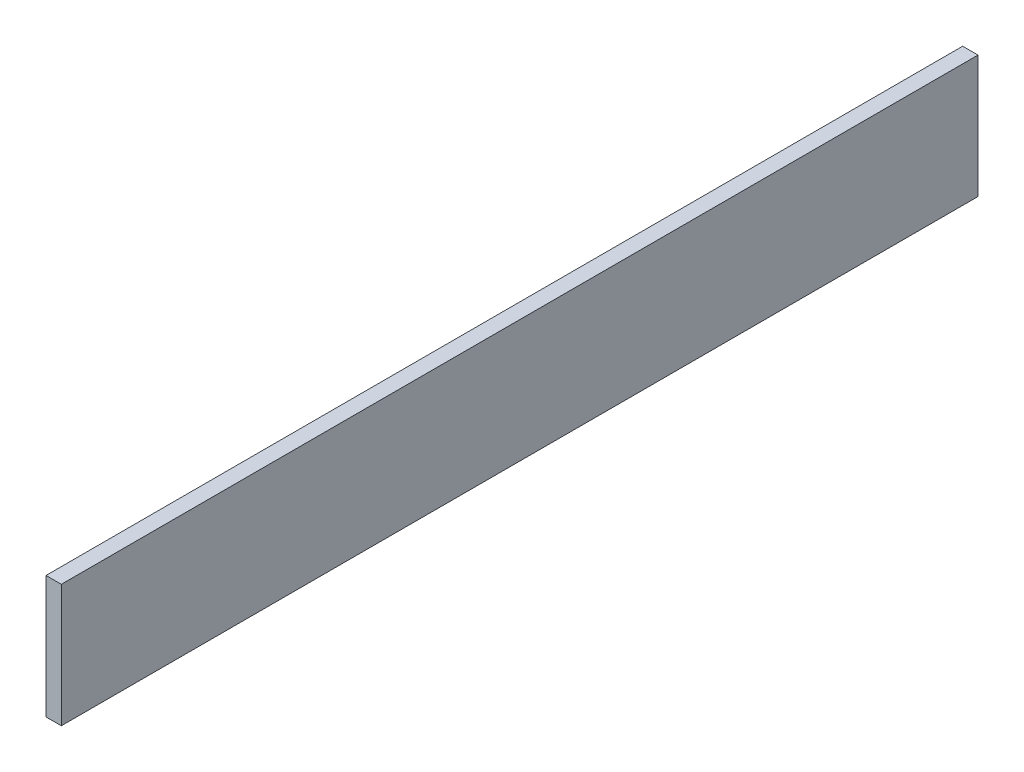
ISO-10303-21;
HEADER;
FILE_DESCRIPTION(('STEP AP214'),'2;1');
FILE_NAME('part.step','',(''),(''),'','','');
FILE_SCHEMA(('AUTOMOTIVE_DESIGN { 1 0 10303 214 1 1 1 1 }'));
ENDSEC;
DATA;
#1=APPLICATION_CONTEXT('core data for automotive mechanical design processes');
#2=APPLICATION_PROTOCOL_DEFINITION('international standard','automotive_design',2000,#1);
#3=PRODUCT_CONTEXT('',#1,'mechanical');
#4=PRODUCT('Part','Part','',(#3));
#5=PRODUCT_RELATED_PRODUCT_CATEGORY('part','',(#4));
#6=PRODUCT_DEFINITION_FORMATION('','',#4);
#7=PRODUCT_DEFINITION_CONTEXT('part definition',#1,'design');
#8=PRODUCT_DEFINITION('design','',#6,#7);
#9=PRODUCT_DEFINITION_SHAPE('','',#8);
#10=(LENGTH_UNIT() NAMED_UNIT(*) SI_UNIT(.MILLI.,.METRE.));
#11=(NAMED_UNIT(*) PLANE_ANGLE_UNIT() SI_UNIT($,.RADIAN.));
#12=(NAMED_UNIT(*) SI_UNIT($,.STERADIAN.) SOLID_ANGLE_UNIT());
#13=UNCERTAINTY_MEASURE_WITH_UNIT(LENGTH_MEASURE(1.E-05),#10,'distance_accuracy_value','');
#14=(GEOMETRIC_REPRESENTATION_CONTEXT(3) GLOBAL_UNCERTAINTY_ASSIGNED_CONTEXT((#13)) GLOBAL_UNIT_ASSIGNED_CONTEXT((#10,
#11,#12)) REPRESENTATION_CONTEXT('',''));
#15=CARTESIAN_POINT('',(0.,0.,0.));
#16=DIRECTION('',(0.,0.,1.));
#17=DIRECTION('',(1.,0.,0.));
#18=AXIS2_PLACEMENT_3D('',#15,#16,#17);
#19=CARTESIAN_POINT('',(3.175,11.5950477916797,1.0931424376821));
#20=DIRECTION('',(0.,0.,-1.));
#21=DIRECTION('',(0.,1.,0.));
#22=AXIS2_PLACEMENT_3D('',#19,#20,#21);
#23=PLANE('',#22);
#24=DIRECTION('',(0.,-1.,0.));
#25=VECTOR('',#24,1.);
#26=CARTESIAN_POINT('',(0.,11.5950477916797,1.0931424376821));
#27=LINE('',#26,#25);
#28=CARTESIAN_POINT('',(0.,11.5950477916797,1.0931424376821));
#29=VERTEX_POINT('',#28);
#30=CARTESIAN_POINT('',(0.,-13.8049522083203,1.0931424376821));
#31=VERTEX_POINT('',#30);
#32=EDGE_CURVE('E115',#29,#31,#27,.T.);
#33=ORIENTED_EDGE('',*,*,#32,.T.);
#34=DIRECTION('',(-1.,0.,0.));
#35=VECTOR('',#34,1.);
#36=CARTESIAN_POINT('',(3.175,-13.8049522083203,1.0931424376821));
#37=LINE('',#36,#35);
#38=CARTESIAN_POINT('',(3.175,-13.8049522083203,1.0931424376821));
#39=VERTEX_POINT('',#38);
#40=EDGE_CURVE('E11',#39,#31,#37,.T.);
#41=ORIENTED_EDGE('',*,*,#40,.F.);
#42=DIRECTION('',(0.,-1.,0.));
#43=VECTOR('',#42,1.);
#44=CARTESIAN_POINT('',(3.175,11.5950477916797,1.0931424376821));
#45=LINE('',#44,#43);
#46=CARTESIAN_POINT('',(3.175,11.5950477916797,1.0931424376821));
#47=VERTEX_POINT('',#46);
#48=EDGE_CURVE('E97',#47,#39,#45,.T.);
#49=ORIENTED_EDGE('',*,*,#48,.F.);
#50=DIRECTION('',(-1.,0.,0.));
#51=VECTOR('',#50,1.);
#52=CARTESIAN_POINT('',(3.175,11.5950477916797,1.0931424376821));
#53=LINE('',#52,#51);
#54=EDGE_CURVE('E111',#47,#29,#53,.T.);
#55=ORIENTED_EDGE('',*,*,#54,.T.);
#56=EDGE_LOOP('',(#33,#41,#49,#55));
#57=FACE_BOUND('',#56,.T.);
#58=ADVANCED_FACE('F39',(#57),#23,.F.);
#59=CARTESIAN_POINT('',(3.175,-13.8049522083203,1.0931424376821));
#60=DIRECTION('',(0.,1.,0.));
#61=DIRECTION('',(0.,0.,1.));
#62=AXIS2_PLACEMENT_3D('',#59,#60,#61);
#63=PLANE('',#62);
#64=DIRECTION('',(0.,0.,-1.));
#65=VECTOR('',#64,1.);
#66=CARTESIAN_POINT('',(0.,-13.8049522083203,1.0931424376821));
#67=LINE('',#66,#65);
#68=CARTESIAN_POINT('',(0.,-13.8049522083203,-188.898857562318));
#69=VERTEX_POINT('',#68);
#70=EDGE_CURVE('E102',#31,#69,#67,.T.);
#71=ORIENTED_EDGE('',*,*,#70,.T.);
#72=DIRECTION('',(-1.,0.,0.));
#73=VECTOR('',#72,1.);
#74=CARTESIAN_POINT('',(3.175,-13.8049522083203,-188.898857562318));
#75=LINE('',#74,#73);
#76=CARTESIAN_POINT('',(3.175,-13.8049522083203,-188.898857562318));
#77=VERTEX_POINT('',#76);
#78=EDGE_CURVE('E48',#77,#69,#75,.T.);
#79=ORIENTED_EDGE('',*,*,#78,.F.);
#80=DIRECTION('',(0.,0.,-1.));
#81=VECTOR('',#80,1.);
#82=CARTESIAN_POINT('',(3.175,-13.8049522083203,1.0931424376821));
#83=LINE('',#82,#81);
#84=EDGE_CURVE('E91',#39,#77,#83,.T.);
#85=ORIENTED_EDGE('',*,*,#84,.F.);
#86=ORIENTED_EDGE('',*,*,#40,.T.);
#87=EDGE_LOOP('',(#71,#79,#85,#86));
#88=FACE_BOUND('',#87,.T.);
#89=ADVANCED_FACE('F101',(#88),#63,.F.);
#90=CARTESIAN_POINT('',(3.175,11.5950477916797,-188.898857562318));
#91=DIRECTION('',(0.,0.,1.));
#92=DIRECTION('',(1.,0.,0.));
#93=AXIS2_PLACEMENT_3D('',#90,#91,#92);
#94=PLANE('',#93);
#95=DIRECTION('',(0.,1.,0.));
#96=VECTOR('',#95,1.);
#97=CARTESIAN_POINT('',(0.,11.5950477916797,-188.898857562318));
#98=LINE('',#97,#96);
#99=CARTESIAN_POINT('',(0.,11.5950477916797,-188.898857562318));
#100=VERTEX_POINT('',#99);
#101=EDGE_CURVE('E77',#69,#100,#98,.T.);
#102=ORIENTED_EDGE('',*,*,#101,.T.);
#103=DIRECTION('',(-1.,0.,0.));
#104=VECTOR('',#103,1.);
#105=CARTESIAN_POINT('',(3.175,11.5950477916797,-188.898857562318));
#106=LINE('',#105,#104);
#107=CARTESIAN_POINT('',(3.175,11.5950477916797,-188.898857562318));
#108=VERTEX_POINT('',#107);
#109=EDGE_CURVE('E104',#108,#100,#106,.T.);
#110=ORIENTED_EDGE('',*,*,#109,.F.);
#111=DIRECTION('',(0.,1.,0.));
#112=VECTOR('',#111,1.);
#113=CARTESIAN_POINT('',(3.175,11.5950477916797,-188.898857562318));
#114=LINE('',#113,#112);
#115=EDGE_CURVE('E95',#77,#108,#114,.T.);
#116=ORIENTED_EDGE('',*,*,#115,.F.);
#117=ORIENTED_EDGE('',*,*,#78,.T.);
#118=EDGE_LOOP('',(#102,#110,#116,#117));
#119=FACE_BOUND('',#118,.T.);
#120=ADVANCED_FACE('F105',(#119),#94,.F.);
#121=CARTESIAN_POINT('',(3.175,11.5950477916797,1.0931424376821));
#122=DIRECTION('',(0.,-1.,0.));
#123=DIRECTION('',(0.,0.,-1.));
#124=AXIS2_PLACEMENT_3D('',#121,#122,#123);
#125=PLANE('',#124);
#126=DIRECTION('',(0.,0.,1.));
#127=VECTOR('',#126,1.);
#128=CARTESIAN_POINT('',(0.,11.5950477916797,1.0931424376821));
#129=LINE('',#128,#127);
#130=EDGE_CURVE('E83',#100,#29,#129,.T.);
#131=ORIENTED_EDGE('',*,*,#130,.T.);
#132=ORIENTED_EDGE('',*,*,#54,.F.);
#133=DIRECTION('',(0.,0.,1.));
#134=VECTOR('',#133,1.);
#135=CARTESIAN_POINT('',(3.175,11.5950477916797,1.0931424376821));
#136=LINE('',#135,#134);
#137=EDGE_CURVE('E56',#108,#47,#136,.T.);
#138=ORIENTED_EDGE('',*,*,#137,.F.);
#139=ORIENTED_EDGE('',*,*,#109,.T.);
#140=EDGE_LOOP('',(#131,#132,#138,#139));
#141=FACE_BOUND('',#140,.T.);
#142=ADVANCED_FACE('F125',(#141),#125,.F.);
#143=CARTESIAN_POINT('',(3.175,0.,0.));
#144=DIRECTION('',(1.,0.,0.));
#145=DIRECTION('',(0.,0.,-1.));
#146=AXIS2_PLACEMENT_3D('',#143,#144,#145);
#147=PLANE('',#146);
#148=ORIENTED_EDGE('',*,*,#48,.T.);
#149=ORIENTED_EDGE('',*,*,#84,.T.);
#150=ORIENTED_EDGE('',*,*,#115,.T.);
#151=ORIENTED_EDGE('',*,*,#137,.T.);
#152=EDGE_LOOP('',(#148,#149,#150,#151));
#153=FACE_BOUND('',#152,.T.);
#154=ADVANCED_FACE('F93',(#153),#147,.T.);
#155=CARTESIAN_POINT('',(0.,0.,0.));
#156=DIRECTION('',(1.,0.,0.));
#157=DIRECTION('',(0.,0.,-1.));
#158=AXIS2_PLACEMENT_3D('',#155,#156,#157);
#159=PLANE('',#158);
#160=ORIENTED_EDGE('',*,*,#32,.F.);
#161=ORIENTED_EDGE('',*,*,#130,.F.);
#162=ORIENTED_EDGE('',*,*,#101,.F.);
#163=ORIENTED_EDGE('',*,*,#70,.F.);
#164=EDGE_LOOP('',(#160,#161,#162,#163));
#165=FACE_BOUND('',#164,.T.);
#166=ADVANCED_FACE('F128',(#165),#159,.F.);
#167=CLOSED_SHELL('',(#58,#89,#120,#142,#154,#166));
#168=MANIFOLD_SOLID_BREP('B2',#167);
#169=ADVANCED_BREP_SHAPE_REPRESENTATION('',(#18,#168),#14);
#170=SHAPE_DEFINITION_REPRESENTATION(#9,#169);
ENDSEC;
END-ISO-10303-21;
